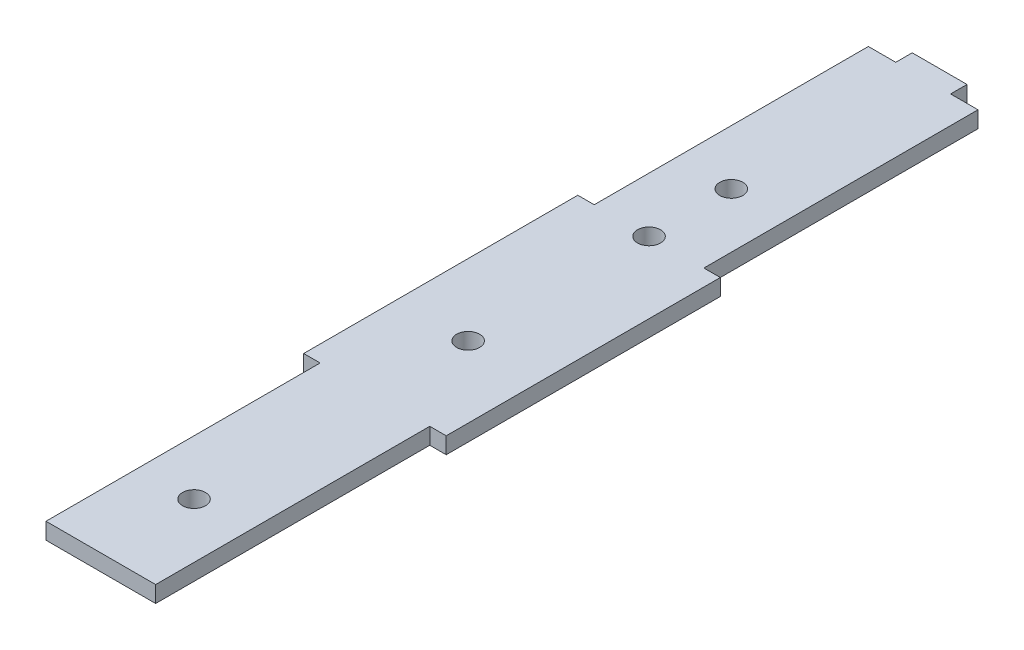
ISO-10303-21;
HEADER;
FILE_DESCRIPTION(('STEP AP214'),'2;1');
FILE_NAME('part.step','',(''),(''),'','','');
FILE_SCHEMA(('AUTOMOTIVE_DESIGN { 1 0 10303 214 1 1 1 1 }'));
ENDSEC;
DATA;
#1=APPLICATION_CONTEXT('core data for automotive mechanical design processes');
#2=APPLICATION_PROTOCOL_DEFINITION('international standard','automotive_design',2000,#1);
#3=PRODUCT_CONTEXT('',#1,'mechanical');
#4=PRODUCT('Part','Part','',(#3));
#5=PRODUCT_RELATED_PRODUCT_CATEGORY('part','',(#4));
#6=PRODUCT_DEFINITION_FORMATION('','',#4);
#7=PRODUCT_DEFINITION_CONTEXT('part definition',#1,'design');
#8=PRODUCT_DEFINITION('design','',#6,#7);
#9=PRODUCT_DEFINITION_SHAPE('','',#8);
#10=(LENGTH_UNIT() NAMED_UNIT(*) SI_UNIT(.MILLI.,.METRE.));
#11=(NAMED_UNIT(*) PLANE_ANGLE_UNIT() SI_UNIT($,.RADIAN.));
#12=(NAMED_UNIT(*) SI_UNIT($,.STERADIAN.) SOLID_ANGLE_UNIT());
#13=UNCERTAINTY_MEASURE_WITH_UNIT(LENGTH_MEASURE(1.E-05),#10,'distance_accuracy_value','');
#14=(GEOMETRIC_REPRESENTATION_CONTEXT(3) GLOBAL_UNCERTAINTY_ASSIGNED_CONTEXT((#13)) GLOBAL_UNIT_ASSIGNED_CONTEXT((#10,
#11,#12)) REPRESENTATION_CONTEXT('',''));
#15=CARTESIAN_POINT('',(0.,0.,0.));
#16=DIRECTION('',(0.,0.,1.));
#17=DIRECTION('',(1.,0.,0.));
#18=AXIS2_PLACEMENT_3D('',#15,#16,#17);
#19=CARTESIAN_POINT('',(0.,3.,0.));
#20=DIRECTION('',(1.,0.,0.));
#21=DIRECTION('',(0.,0.,-1.));
#22=AXIS2_PLACEMENT_3D('',#19,#20,#21);
#23=PLANE('',#22);
#24=DIRECTION('',(0.,0.,1.));
#25=VECTOR('',#24,1.);
#26=CARTESIAN_POINT('',(0.,0.,0.));
#27=LINE('',#26,#25);
#28=CARTESIAN_POINT('',(0.,0.,0.));
#29=VERTEX_POINT('',#28);
#30=CARTESIAN_POINT('',(0.,0.,50.));
#31=VERTEX_POINT('',#30);
#32=EDGE_CURVE('E179',#29,#31,#27,.T.);
#33=ORIENTED_EDGE('',*,*,#32,.T.);
#34=DIRECTION('',(0.,-1.,0.));
#35=VECTOR('',#34,1.);
#36=CARTESIAN_POINT('',(0.,3.,50.));
#37=LINE('',#36,#35);
#38=CARTESIAN_POINT('',(0.,3.,50.));
#39=VERTEX_POINT('',#38);
#40=EDGE_CURVE('E11',#39,#31,#37,.T.);
#41=ORIENTED_EDGE('',*,*,#40,.F.);
#42=DIRECTION('',(0.,0.,1.));
#43=VECTOR('',#42,1.);
#44=CARTESIAN_POINT('',(0.,3.,0.));
#45=LINE('',#44,#43);
#46=CARTESIAN_POINT('',(0.,3.,0.));
#47=VERTEX_POINT('',#46);
#48=EDGE_CURVE('E210',#47,#39,#45,.T.);
#49=ORIENTED_EDGE('',*,*,#48,.F.);
#50=DIRECTION('',(0.,-1.,0.));
#51=VECTOR('',#50,1.);
#52=CARTESIAN_POINT('',(0.,3.,0.));
#53=LINE('',#52,#51);
#54=EDGE_CURVE('E175',#47,#29,#53,.T.);
#55=ORIENTED_EDGE('',*,*,#54,.T.);
#56=EDGE_LOOP('',(#33,#41,#49,#55));
#57=FACE_BOUND('',#56,.T.);
#58=ADVANCED_FACE('F35',(#57),#23,.F.);
#59=CARTESIAN_POINT('',(0.,3.,50.));
#60=DIRECTION('',(0.,0.,1.));
#61=DIRECTION('',(1.,0.,0.));
#62=AXIS2_PLACEMENT_3D('',#59,#60,#61);
#63=PLANE('',#62);
#64=DIRECTION('',(-1.,0.,0.));
#65=VECTOR('',#64,1.);
#66=CARTESIAN_POINT('',(0.,0.,50.));
#67=LINE('',#66,#65);
#68=CARTESIAN_POINT('',(-3.,0.,50.));
#69=VERTEX_POINT('',#68);
#70=EDGE_CURVE('E182',#31,#69,#67,.T.);
#71=ORIENTED_EDGE('',*,*,#70,.T.);
#72=DIRECTION('',(0.,-1.,0.));
#73=VECTOR('',#72,1.);
#74=CARTESIAN_POINT('',(-3.,3.,50.));
#75=LINE('',#74,#73);
#76=CARTESIAN_POINT('',(-3.,3.,50.));
#77=VERTEX_POINT('',#76);
#78=EDGE_CURVE('E43',#77,#69,#75,.T.);
#79=ORIENTED_EDGE('',*,*,#78,.F.);
#80=DIRECTION('',(-1.,0.,0.));
#81=VECTOR('',#80,1.);
#82=CARTESIAN_POINT('',(0.,3.,50.));
#83=LINE('',#82,#81);
#84=EDGE_CURVE('E118',#39,#77,#83,.T.);
#85=ORIENTED_EDGE('',*,*,#84,.F.);
#86=ORIENTED_EDGE('',*,*,#40,.T.);
#87=EDGE_LOOP('',(#71,#79,#85,#86));
#88=FACE_BOUND('',#87,.T.);
#89=ADVANCED_FACE('F310',(#88),#63,.F.);
#90=CARTESIAN_POINT('',(-3.,3.,50.));
#91=DIRECTION('',(1.,0.,0.));
#92=DIRECTION('',(0.,0.,-1.));
#93=AXIS2_PLACEMENT_3D('',#90,#91,#92);
#94=PLANE('',#93);
#95=DIRECTION('',(0.,0.,1.));
#96=VECTOR('',#95,1.);
#97=CARTESIAN_POINT('',(-3.,0.,50.));
#98=LINE('',#97,#96);
#99=CARTESIAN_POINT('',(-2.99999999999999,0.,100.));
#100=VERTEX_POINT('',#99);
#101=EDGE_CURVE('E185',#69,#100,#98,.T.);
#102=ORIENTED_EDGE('',*,*,#101,.T.);
#103=DIRECTION('',(0.,-1.,0.));
#104=VECTOR('',#103,1.);
#105=CARTESIAN_POINT('',(-2.99999999999999,3.,100.));
#106=LINE('',#105,#104);
#107=CARTESIAN_POINT('',(-2.99999999999999,3.,100.));
#108=VERTEX_POINT('',#107);
#109=EDGE_CURVE('E241',#108,#100,#106,.T.);
#110=ORIENTED_EDGE('',*,*,#109,.F.);
#111=DIRECTION('',(0.,0.,1.));
#112=VECTOR('',#111,1.);
#113=CARTESIAN_POINT('',(-3.,3.,50.));
#114=LINE('',#113,#112);
#115=EDGE_CURVE('E249',#77,#108,#114,.T.);
#116=ORIENTED_EDGE('',*,*,#115,.F.);
#117=ORIENTED_EDGE('',*,*,#78,.T.);
#118=EDGE_LOOP('',(#102,#110,#116,#117));
#119=FACE_BOUND('',#118,.T.);
#120=ADVANCED_FACE('F247',(#119),#94,.F.);
#121=CARTESIAN_POINT('',(0.,3.,100.));
#122=DIRECTION('',(0.,0.,-1.));
#123=DIRECTION('',(-1.,0.,0.));
#124=AXIS2_PLACEMENT_3D('',#121,#122,#123);
#125=PLANE('',#124);
#126=DIRECTION('',(1.,0.,0.));
#127=VECTOR('',#126,1.);
#128=CARTESIAN_POINT('',(0.,0.,100.));
#129=LINE('',#128,#127);
#130=CARTESIAN_POINT('',(0.,0.,100.));
#131=VERTEX_POINT('',#130);
#132=EDGE_CURVE('E187',#100,#131,#129,.T.);
#133=ORIENTED_EDGE('',*,*,#132,.T.);
#134=DIRECTION('',(0.,-1.,0.));
#135=VECTOR('',#134,1.);
#136=CARTESIAN_POINT('',(0.,3.,100.));
#137=LINE('',#136,#135);
#138=CARTESIAN_POINT('',(0.,3.,100.));
#139=VERTEX_POINT('',#138);
#140=EDGE_CURVE('E238',#139,#131,#137,.T.);
#141=ORIENTED_EDGE('',*,*,#140,.F.);
#142=DIRECTION('',(1.,0.,0.));
#143=VECTOR('',#142,1.);
#144=CARTESIAN_POINT('',(0.,3.,100.));
#145=LINE('',#144,#143);
#146=EDGE_CURVE('E267',#108,#139,#145,.T.);
#147=ORIENTED_EDGE('',*,*,#146,.F.);
#148=ORIENTED_EDGE('',*,*,#109,.T.);
#149=EDGE_LOOP('',(#133,#141,#147,#148));
#150=FACE_BOUND('',#149,.T.);
#151=ADVANCED_FACE('F258',(#150),#125,.F.);
#152=CARTESIAN_POINT('',(0.,3.,100.));
#153=DIRECTION('',(1.,0.,0.));
#154=DIRECTION('',(0.,0.,-1.));
#155=AXIS2_PLACEMENT_3D('',#152,#153,#154);
#156=PLANE('',#155);
#157=DIRECTION('',(0.,0.,1.));
#158=VECTOR('',#157,1.);
#159=CARTESIAN_POINT('',(0.,0.,100.));
#160=LINE('',#159,#158);
#161=CARTESIAN_POINT('',(0.,0.,150.));
#162=VERTEX_POINT('',#161);
#163=EDGE_CURVE('E189',#131,#162,#160,.T.);
#164=ORIENTED_EDGE('',*,*,#163,.T.);
#165=DIRECTION('',(0.,-1.,0.));
#166=VECTOR('',#165,1.);
#167=CARTESIAN_POINT('',(0.,3.,150.));
#168=LINE('',#167,#166);
#169=CARTESIAN_POINT('',(0.,3.,150.));
#170=VERTEX_POINT('',#169);
#171=EDGE_CURVE('E235',#170,#162,#168,.T.);
#172=ORIENTED_EDGE('',*,*,#171,.F.);
#173=DIRECTION('',(0.,0.,1.));
#174=VECTOR('',#173,1.);
#175=CARTESIAN_POINT('',(0.,3.,100.));
#176=LINE('',#175,#174);
#177=EDGE_CURVE('E264',#139,#170,#176,.T.);
#178=ORIENTED_EDGE('',*,*,#177,.F.);
#179=ORIENTED_EDGE('',*,*,#140,.T.);
#180=EDGE_LOOP('',(#164,#172,#178,#179));
#181=FACE_BOUND('',#180,.T.);
#182=ADVANCED_FACE('F262',(#181),#156,.F.);
#183=CARTESIAN_POINT('',(0.,3.,150.));
#184=DIRECTION('',(0.,0.,-1.));
#185=DIRECTION('',(-1.,0.,0.));
#186=AXIS2_PLACEMENT_3D('',#183,#184,#185);
#187=PLANE('',#186);
#188=DIRECTION('',(1.,0.,0.));
#189=VECTOR('',#188,1.);
#190=CARTESIAN_POINT('',(0.,0.,150.));
#191=LINE('',#190,#189);
#192=CARTESIAN_POINT('',(20.,0.,150.));
#193=VERTEX_POINT('',#192);
#194=EDGE_CURVE('E191',#162,#193,#191,.T.);
#195=ORIENTED_EDGE('',*,*,#194,.T.);
#196=DIRECTION('',(0.,-1.,0.));
#197=VECTOR('',#196,1.);
#198=CARTESIAN_POINT('',(20.,3.,150.));
#199=LINE('',#198,#197);
#200=CARTESIAN_POINT('',(20.,3.,150.));
#201=VERTEX_POINT('',#200);
#202=EDGE_CURVE('E232',#201,#193,#199,.T.);
#203=ORIENTED_EDGE('',*,*,#202,.F.);
#204=DIRECTION('',(1.,0.,0.));
#205=VECTOR('',#204,1.);
#206=CARTESIAN_POINT('',(0.,3.,150.));
#207=LINE('',#206,#205);
#208=EDGE_CURVE('E266',#170,#201,#207,.T.);
#209=ORIENTED_EDGE('',*,*,#208,.F.);
#210=ORIENTED_EDGE('',*,*,#171,.T.);
#211=EDGE_LOOP('',(#195,#203,#209,#210));
#212=FACE_BOUND('',#211,.T.);
#213=ADVANCED_FACE('F323',(#212),#187,.F.);
#214=CARTESIAN_POINT('',(20.,3.,100.));
#215=DIRECTION('',(-1.,0.,0.));
#216=DIRECTION('',(0.,0.,1.));
#217=AXIS2_PLACEMENT_3D('',#214,#215,#216);
#218=PLANE('',#217);
#219=DIRECTION('',(0.,0.,-1.));
#220=VECTOR('',#219,1.);
#221=CARTESIAN_POINT('',(20.,0.,100.));
#222=LINE('',#221,#220);
#223=CARTESIAN_POINT('',(20.,0.,100.));
#224=VERTEX_POINT('',#223);
#225=EDGE_CURVE('E193',#193,#224,#222,.T.);
#226=ORIENTED_EDGE('',*,*,#225,.T.);
#227=DIRECTION('',(0.,-1.,0.));
#228=VECTOR('',#227,1.);
#229=CARTESIAN_POINT('',(20.,3.,100.));
#230=LINE('',#229,#228);
#231=CARTESIAN_POINT('',(20.,3.,100.));
#232=VERTEX_POINT('',#231);
#233=EDGE_CURVE('E229',#232,#224,#230,.T.);
#234=ORIENTED_EDGE('',*,*,#233,.F.);
#235=DIRECTION('',(0.,0.,-1.));
#236=VECTOR('',#235,1.);
#237=CARTESIAN_POINT('',(20.,3.,100.));
#238=LINE('',#237,#236);
#239=EDGE_CURVE('E269',#201,#232,#238,.T.);
#240=ORIENTED_EDGE('',*,*,#239,.F.);
#241=ORIENTED_EDGE('',*,*,#202,.T.);
#242=EDGE_LOOP('',(#226,#234,#240,#241));
#243=FACE_BOUND('',#242,.T.);
#244=ADVANCED_FACE('F326',(#243),#218,.F.);
#245=CARTESIAN_POINT('',(20.,3.,100.));
#246=DIRECTION('',(0.,0.,-1.));
#247=DIRECTION('',(-1.,0.,0.));
#248=AXIS2_PLACEMENT_3D('',#245,#246,#247);
#249=PLANE('',#248);
#250=DIRECTION('',(1.,0.,0.));
#251=VECTOR('',#250,1.);
#252=CARTESIAN_POINT('',(20.,0.,100.));
#253=LINE('',#252,#251);
#254=CARTESIAN_POINT('',(23.,0.,100.));
#255=VERTEX_POINT('',#254);
#256=EDGE_CURVE('E195',#224,#255,#253,.T.);
#257=ORIENTED_EDGE('',*,*,#256,.T.);
#258=DIRECTION('',(0.,-1.,0.));
#259=VECTOR('',#258,1.);
#260=CARTESIAN_POINT('',(23.,3.,100.));
#261=LINE('',#260,#259);
#262=CARTESIAN_POINT('',(23.,3.,100.));
#263=VERTEX_POINT('',#262);
#264=EDGE_CURVE('E226',#263,#255,#261,.T.);
#265=ORIENTED_EDGE('',*,*,#264,.F.);
#266=DIRECTION('',(1.,0.,0.));
#267=VECTOR('',#266,1.);
#268=CARTESIAN_POINT('',(20.,3.,100.));
#269=LINE('',#268,#267);
#270=EDGE_CURVE('E275',#232,#263,#269,.T.);
#271=ORIENTED_EDGE('',*,*,#270,.F.);
#272=ORIENTED_EDGE('',*,*,#233,.T.);
#273=EDGE_LOOP('',(#257,#265,#271,#272));
#274=FACE_BOUND('',#273,.T.);
#275=ADVANCED_FACE('F330',(#274),#249,.F.);
#276=CARTESIAN_POINT('',(23.,3.,50.));
#277=DIRECTION('',(-1.,0.,0.));
#278=DIRECTION('',(0.,0.,1.));
#279=AXIS2_PLACEMENT_3D('',#276,#277,#278);
#280=PLANE('',#279);
#281=DIRECTION('',(0.,0.,-1.));
#282=VECTOR('',#281,1.);
#283=CARTESIAN_POINT('',(23.,0.,50.));
#284=LINE('',#283,#282);
#285=CARTESIAN_POINT('',(23.,0.,50.));
#286=VERTEX_POINT('',#285);
#287=EDGE_CURVE('E197',#255,#286,#284,.T.);
#288=ORIENTED_EDGE('',*,*,#287,.T.);
#289=DIRECTION('',(0.,-1.,0.));
#290=VECTOR('',#289,1.);
#291=CARTESIAN_POINT('',(23.,3.,50.));
#292=LINE('',#291,#290);
#293=CARTESIAN_POINT('',(23.,3.,50.));
#294=VERTEX_POINT('',#293);
#295=EDGE_CURVE('E223',#294,#286,#292,.T.);
#296=ORIENTED_EDGE('',*,*,#295,.F.);
#297=DIRECTION('',(0.,0.,-1.));
#298=VECTOR('',#297,1.);
#299=CARTESIAN_POINT('',(23.,3.,50.));
#300=LINE('',#299,#298);
#301=EDGE_CURVE('E277',#263,#294,#300,.T.);
#302=ORIENTED_EDGE('',*,*,#301,.F.);
#303=ORIENTED_EDGE('',*,*,#264,.T.);
#304=EDGE_LOOP('',(#288,#296,#302,#303));
#305=FACE_BOUND('',#304,.T.);
#306=ADVANCED_FACE('F334',(#305),#280,.F.);
#307=CARTESIAN_POINT('',(20.,3.,50.));
#308=DIRECTION('',(0.,0.,1.));
#309=DIRECTION('',(1.,0.,0.));
#310=AXIS2_PLACEMENT_3D('',#307,#308,#309);
#311=PLANE('',#310);
#312=DIRECTION('',(-1.,0.,0.));
#313=VECTOR('',#312,1.);
#314=CARTESIAN_POINT('',(20.,0.,50.));
#315=LINE('',#314,#313);
#316=CARTESIAN_POINT('',(20.,0.,50.));
#317=VERTEX_POINT('',#316);
#318=EDGE_CURVE('E199',#286,#317,#315,.T.);
#319=ORIENTED_EDGE('',*,*,#318,.T.);
#320=DIRECTION('',(0.,-1.,0.));
#321=VECTOR('',#320,1.);
#322=CARTESIAN_POINT('',(20.,3.,50.));
#323=LINE('',#322,#321);
#324=CARTESIAN_POINT('',(20.,3.,50.));
#325=VERTEX_POINT('',#324);
#326=EDGE_CURVE('E220',#325,#317,#323,.T.);
#327=ORIENTED_EDGE('',*,*,#326,.F.);
#328=DIRECTION('',(-1.,0.,0.));
#329=VECTOR('',#328,1.);
#330=CARTESIAN_POINT('',(20.,3.,50.));
#331=LINE('',#330,#329);
#332=EDGE_CURVE('E279',#294,#325,#331,.T.);
#333=ORIENTED_EDGE('',*,*,#332,.F.);
#334=ORIENTED_EDGE('',*,*,#295,.T.);
#335=EDGE_LOOP('',(#319,#327,#333,#334));
#336=FACE_BOUND('',#335,.T.);
#337=ADVANCED_FACE('F338',(#336),#311,.F.);
#338=CARTESIAN_POINT('',(20.,3.,0.));
#339=DIRECTION('',(-1.,0.,0.));
#340=DIRECTION('',(0.,0.,1.));
#341=AXIS2_PLACEMENT_3D('',#338,#339,#340);
#342=PLANE('',#341);
#343=DIRECTION('',(0.,0.,-1.));
#344=VECTOR('',#343,1.);
#345=CARTESIAN_POINT('',(20.,0.,0.));
#346=LINE('',#345,#344);
#347=CARTESIAN_POINT('',(20.,0.,0.));
#348=VERTEX_POINT('',#347);
#349=EDGE_CURVE('E201',#317,#348,#346,.T.);
#350=ORIENTED_EDGE('',*,*,#349,.T.);
#351=DIRECTION('',(0.,-1.,0.));
#352=VECTOR('',#351,1.);
#353=CARTESIAN_POINT('',(20.,3.,0.));
#354=LINE('',#353,#352);
#355=CARTESIAN_POINT('',(20.,3.,0.));
#356=VERTEX_POINT('',#355);
#357=EDGE_CURVE('E217',#356,#348,#354,.T.);
#358=ORIENTED_EDGE('',*,*,#357,.F.);
#359=DIRECTION('',(0.,0.,-1.));
#360=VECTOR('',#359,1.);
#361=CARTESIAN_POINT('',(20.,3.,0.));
#362=LINE('',#361,#360);
#363=EDGE_CURVE('E281',#325,#356,#362,.T.);
#364=ORIENTED_EDGE('',*,*,#363,.F.);
#365=ORIENTED_EDGE('',*,*,#326,.T.);
#366=EDGE_LOOP('',(#350,#358,#364,#365));
#367=FACE_BOUND('',#366,.T.);
#368=ADVANCED_FACE('F342',(#367),#342,.F.);
#369=CARTESIAN_POINT('',(15.,3.,0.));
#370=DIRECTION('',(0.,0.,1.));
#371=DIRECTION('',(1.,0.,0.));
#372=AXIS2_PLACEMENT_3D('',#369,#370,#371);
#373=PLANE('',#372);
#374=DIRECTION('',(-1.,0.,0.));
#375=VECTOR('',#374,1.);
#376=CARTESIAN_POINT('',(15.,0.,0.));
#377=LINE('',#376,#375);
#378=CARTESIAN_POINT('',(15.,0.,0.));
#379=VERTEX_POINT('',#378);
#380=EDGE_CURVE('E203',#348,#379,#377,.T.);
#381=ORIENTED_EDGE('',*,*,#380,.T.);
#382=DIRECTION('',(0.,-1.,0.));
#383=VECTOR('',#382,1.);
#384=CARTESIAN_POINT('',(15.,3.,0.));
#385=LINE('',#384,#383);
#386=CARTESIAN_POINT('',(15.,3.,0.));
#387=VERTEX_POINT('',#386);
#388=EDGE_CURVE('E214',#387,#379,#385,.T.);
#389=ORIENTED_EDGE('',*,*,#388,.F.);
#390=DIRECTION('',(-1.,0.,0.));
#391=VECTOR('',#390,1.);
#392=CARTESIAN_POINT('',(15.,3.,0.));
#393=LINE('',#392,#391);
#394=EDGE_CURVE('E283',#356,#387,#393,.T.);
#395=ORIENTED_EDGE('',*,*,#394,.F.);
#396=ORIENTED_EDGE('',*,*,#357,.T.);
#397=EDGE_LOOP('',(#381,#389,#395,#396));
#398=FACE_BOUND('',#397,.T.);
#399=ADVANCED_FACE('F289',(#398),#373,.F.);
#400=CARTESIAN_POINT('',(15.,3.,-3.));
#401=DIRECTION('',(-1.,0.,0.));
#402=DIRECTION('',(0.,0.,1.));
#403=AXIS2_PLACEMENT_3D('',#400,#401,#402);
#404=PLANE('',#403);
#405=DIRECTION('',(0.,0.,-1.));
#406=VECTOR('',#405,1.);
#407=CARTESIAN_POINT('',(15.,0.,-3.));
#408=LINE('',#407,#406);
#409=CARTESIAN_POINT('',(15.,0.,-3.));
#410=VERTEX_POINT('',#409);
#411=EDGE_CURVE('E205',#379,#410,#408,.T.);
#412=ORIENTED_EDGE('',*,*,#411,.T.);
#413=DIRECTION('',(0.,-1.,0.));
#414=VECTOR('',#413,1.);
#415=CARTESIAN_POINT('',(15.,3.,-3.));
#416=LINE('',#415,#414);
#417=CARTESIAN_POINT('',(15.,3.,-3.));
#418=VERTEX_POINT('',#417);
#419=EDGE_CURVE('E170',#418,#410,#416,.T.);
#420=ORIENTED_EDGE('',*,*,#419,.F.);
#421=DIRECTION('',(0.,0.,-1.));
#422=VECTOR('',#421,1.);
#423=CARTESIAN_POINT('',(15.,3.,-3.));
#424=LINE('',#423,#422);
#425=EDGE_CURVE('E161',#387,#418,#424,.T.);
#426=ORIENTED_EDGE('',*,*,#425,.F.);
#427=ORIENTED_EDGE('',*,*,#388,.T.);
#428=EDGE_LOOP('',(#412,#420,#426,#427));
#429=FACE_BOUND('',#428,.T.);
#430=ADVANCED_FACE('F293',(#429),#404,.F.);
#431=CARTESIAN_POINT('',(5.,3.,-3.));
#432=DIRECTION('',(0.,0.,1.));
#433=DIRECTION('',(1.,0.,0.));
#434=AXIS2_PLACEMENT_3D('',#431,#432,#433);
#435=PLANE('',#434);
#436=DIRECTION('',(-1.,0.,0.));
#437=VECTOR('',#436,1.);
#438=CARTESIAN_POINT('',(5.,0.,-3.));
#439=LINE('',#438,#437);
#440=CARTESIAN_POINT('',(5.,0.,-3.));
#441=VERTEX_POINT('',#440);
#442=EDGE_CURVE('E169',#410,#441,#439,.T.);
#443=ORIENTED_EDGE('',*,*,#442,.T.);
#444=DIRECTION('',(0.,-1.,0.));
#445=VECTOR('',#444,1.);
#446=CARTESIAN_POINT('',(5.,3.,-3.));
#447=LINE('',#446,#445);
#448=CARTESIAN_POINT('',(5.,3.,-3.));
#449=VERTEX_POINT('',#448);
#450=EDGE_CURVE('E166',#449,#441,#447,.T.);
#451=ORIENTED_EDGE('',*,*,#450,.F.);
#452=DIRECTION('',(-1.,0.,0.));
#453=VECTOR('',#452,1.);
#454=CARTESIAN_POINT('',(5.,3.,-3.));
#455=LINE('',#454,#453);
#456=EDGE_CURVE('E155',#418,#449,#455,.T.);
#457=ORIENTED_EDGE('',*,*,#456,.F.);
#458=ORIENTED_EDGE('',*,*,#419,.T.);
#459=EDGE_LOOP('',(#443,#451,#457,#458));
#460=FACE_BOUND('',#459,.T.);
#461=ADVANCED_FACE('F167',(#460),#435,.F.);
#462=CARTESIAN_POINT('',(5.,3.,-3.));
#463=DIRECTION('',(1.,0.,0.));
#464=DIRECTION('',(0.,0.,-1.));
#465=AXIS2_PLACEMENT_3D('',#462,#463,#464);
#466=PLANE('',#465);
#467=DIRECTION('',(0.,0.,1.));
#468=VECTOR('',#467,1.);
#469=CARTESIAN_POINT('',(5.,0.,-3.));
#470=LINE('',#469,#468);
#471=CARTESIAN_POINT('',(5.,0.,0.));
#472=VERTEX_POINT('',#471);
#473=EDGE_CURVE('E104',#441,#472,#470,.T.);
#474=ORIENTED_EDGE('',*,*,#473,.T.);
#475=DIRECTION('',(0.,-1.,0.));
#476=VECTOR('',#475,1.);
#477=CARTESIAN_POINT('',(5.,3.,0.));
#478=LINE('',#477,#476);
#479=CARTESIAN_POINT('',(5.,3.,0.));
#480=VERTEX_POINT('',#479);
#481=EDGE_CURVE('E171',#480,#472,#478,.T.);
#482=ORIENTED_EDGE('',*,*,#481,.F.);
#483=DIRECTION('',(0.,0.,1.));
#484=VECTOR('',#483,1.);
#485=CARTESIAN_POINT('',(5.,3.,-3.));
#486=LINE('',#485,#484);
#487=EDGE_CURVE('E159',#449,#480,#486,.T.);
#488=ORIENTED_EDGE('',*,*,#487,.F.);
#489=ORIENTED_EDGE('',*,*,#450,.T.);
#490=EDGE_LOOP('',(#474,#482,#488,#489));
#491=FACE_BOUND('',#490,.T.);
#492=ADVANCED_FACE('F173',(#491),#466,.F.);
#493=CARTESIAN_POINT('',(0.,3.,0.));
#494=DIRECTION('',(0.,0.,1.));
#495=DIRECTION('',(1.,0.,0.));
#496=AXIS2_PLACEMENT_3D('',#493,#494,#495);
#497=PLANE('',#496);
#498=DIRECTION('',(-1.,0.,0.));
#499=VECTOR('',#498,1.);
#500=CARTESIAN_POINT('',(0.,0.,0.));
#501=LINE('',#500,#499);
#502=EDGE_CURVE('E110',#472,#29,#501,.T.);
#503=ORIENTED_EDGE('',*,*,#502,.T.);
#504=ORIENTED_EDGE('',*,*,#54,.F.);
#505=DIRECTION('',(-1.,0.,0.));
#506=VECTOR('',#505,1.);
#507=CARTESIAN_POINT('',(0.,3.,0.));
#508=LINE('',#507,#506);
#509=EDGE_CURVE('E51',#480,#47,#508,.T.);
#510=ORIENTED_EDGE('',*,*,#509,.F.);
#511=ORIENTED_EDGE('',*,*,#481,.T.);
#512=EDGE_LOOP('',(#503,#504,#510,#511));
#513=FACE_BOUND('',#512,.T.);
#514=ADVANCED_FACE('F297',(#513),#497,.F.);
#515=CARTESIAN_POINT('',(0.,3.,0.));
#516=DIRECTION('',(0.,-1.,0.));
#517=DIRECTION('',(0.,0.,-1.));
#518=AXIS2_PLACEMENT_3D('',#515,#516,#517);
#519=PLANE('',#518);
#520=CARTESIAN_POINT('',(10.,3.,35.));
#521=DIRECTION('',(0.,1.,0.));
#522=DIRECTION('',(0.,0.,1.));
#523=AXIS2_PLACEMENT_3D('',#520,#521,#522);
#524=CIRCLE('',#523,2.1);
#525=CARTESIAN_POINT('',(10.,3.,37.1));
#526=VERTEX_POINT('',#525);
#527=EDGE_CURVE('E422',#526,#526,#524,.T.);
#528=ORIENTED_EDGE('',*,*,#527,.F.);
#529=EDGE_LOOP('',(#528));
#530=FACE_BOUND('',#529,.T.);
#531=CARTESIAN_POINT('',(10.,3.,50.));
#532=DIRECTION('',(0.,1.,0.));
#533=DIRECTION('',(0.,0.,1.));
#534=AXIS2_PLACEMENT_3D('',#531,#532,#533);
#535=CIRCLE('',#534,2.1);
#536=CARTESIAN_POINT('',(10.,3.,52.1));
#537=VERTEX_POINT('',#536);
#538=EDGE_CURVE('E427',#537,#537,#535,.T.);
#539=ORIENTED_EDGE('',*,*,#538,.F.);
#540=EDGE_LOOP('',(#539));
#541=FACE_BOUND('',#540,.T.);
#542=CARTESIAN_POINT('',(10.,3.,83.));
#543=DIRECTION('',(0.,1.,0.));
#544=DIRECTION('',(0.,0.,1.));
#545=AXIS2_PLACEMENT_3D('',#542,#543,#544);
#546=CIRCLE('',#545,2.1);
#547=CARTESIAN_POINT('',(10.,3.,85.1));
#548=VERTEX_POINT('',#547);
#549=EDGE_CURVE('E435',#548,#548,#546,.T.);
#550=ORIENTED_EDGE('',*,*,#549,.F.);
#551=EDGE_LOOP('',(#550));
#552=FACE_BOUND('',#551,.T.);
#553=CARTESIAN_POINT('',(10.,3.,133.));
#554=DIRECTION('',(0.,1.,0.));
#555=DIRECTION('',(0.,0.,1.));
#556=AXIS2_PLACEMENT_3D('',#553,#554,#555);
#557=CIRCLE('',#556,2.1);
#558=CARTESIAN_POINT('',(10.,3.,135.1));
#559=VERTEX_POINT('',#558);
#560=EDGE_CURVE('E441',#559,#559,#557,.T.);
#561=ORIENTED_EDGE('',*,*,#560,.F.);
#562=EDGE_LOOP('',(#561));
#563=FACE_BOUND('',#562,.T.);
#564=ORIENTED_EDGE('',*,*,#48,.T.);
#565=ORIENTED_EDGE('',*,*,#84,.T.);
#566=ORIENTED_EDGE('',*,*,#115,.T.);
#567=ORIENTED_EDGE('',*,*,#146,.T.);
#568=ORIENTED_EDGE('',*,*,#177,.T.);
#569=ORIENTED_EDGE('',*,*,#208,.T.);
#570=ORIENTED_EDGE('',*,*,#239,.T.);
#571=ORIENTED_EDGE('',*,*,#270,.T.);
#572=ORIENTED_EDGE('',*,*,#301,.T.);
#573=ORIENTED_EDGE('',*,*,#332,.T.);
#574=ORIENTED_EDGE('',*,*,#363,.T.);
#575=ORIENTED_EDGE('',*,*,#394,.T.);
#576=ORIENTED_EDGE('',*,*,#425,.T.);
#577=ORIENTED_EDGE('',*,*,#456,.T.);
#578=ORIENTED_EDGE('',*,*,#487,.T.);
#579=ORIENTED_EDGE('',*,*,#509,.T.);
#580=EDGE_LOOP('',(#564,#565,#566,#567,#568,#569,#570,#571,#572,#573,#574,#575,#576,#577,#578,#579));
#581=FACE_BOUND('',#580,.T.);
#582=ADVANCED_FACE('F157',(#530,#541,#552,#563,#581),#519,.F.);
#583=CARTESIAN_POINT('',(0.,0.,0.));
#584=DIRECTION('',(0.,-1.,0.));
#585=DIRECTION('',(0.,0.,-1.));
#586=AXIS2_PLACEMENT_3D('',#583,#584,#585);
#587=PLANE('',#586);
#588=CARTESIAN_POINT('',(10.,0.,35.));
#589=DIRECTION('',(0.,1.,0.));
#590=DIRECTION('',(0.,0.,1.));
#591=AXIS2_PLACEMENT_3D('',#588,#589,#590);
#592=CIRCLE('',#591,2.1);
#593=CARTESIAN_POINT('',(10.,0.,37.1));
#594=VERTEX_POINT('',#593);
#595=EDGE_CURVE('E183',#594,#594,#592,.T.);
#596=ORIENTED_EDGE('',*,*,#595,.T.);
#597=EDGE_LOOP('',(#596));
#598=FACE_BOUND('',#597,.T.);
#599=CARTESIAN_POINT('',(10.,0.,50.));
#600=DIRECTION('',(0.,1.,0.));
#601=DIRECTION('',(0.,0.,1.));
#602=AXIS2_PLACEMENT_3D('',#599,#600,#601);
#603=CIRCLE('',#602,2.1);
#604=CARTESIAN_POINT('',(10.,0.,52.1));
#605=VERTEX_POINT('',#604);
#606=EDGE_CURVE('E423',#605,#605,#603,.T.);
#607=ORIENTED_EDGE('',*,*,#606,.T.);
#608=EDGE_LOOP('',(#607));
#609=FACE_BOUND('',#608,.T.);
#610=CARTESIAN_POINT('',(10.,0.,83.));
#611=DIRECTION('',(0.,1.,0.));
#612=DIRECTION('',(0.,0.,1.));
#613=AXIS2_PLACEMENT_3D('',#610,#611,#612);
#614=CIRCLE('',#613,2.1);
#615=CARTESIAN_POINT('',(10.,0.,85.1));
#616=VERTEX_POINT('',#615);
#617=EDGE_CURVE('E432',#616,#616,#614,.T.);
#618=ORIENTED_EDGE('',*,*,#617,.T.);
#619=EDGE_LOOP('',(#618));
#620=FACE_BOUND('',#619,.T.);
#621=CARTESIAN_POINT('',(10.,0.,133.));
#622=DIRECTION('',(0.,1.,0.));
#623=DIRECTION('',(0.,0.,1.));
#624=AXIS2_PLACEMENT_3D('',#621,#622,#623);
#625=CIRCLE('',#624,2.1);
#626=CARTESIAN_POINT('',(10.,0.,135.1));
#627=VERTEX_POINT('',#626);
#628=EDGE_CURVE('E438',#627,#627,#625,.T.);
#629=ORIENTED_EDGE('',*,*,#628,.T.);
#630=EDGE_LOOP('',(#629));
#631=FACE_BOUND('',#630,.T.);
#632=ORIENTED_EDGE('',*,*,#32,.F.);
#633=ORIENTED_EDGE('',*,*,#502,.F.);
#634=ORIENTED_EDGE('',*,*,#473,.F.);
#635=ORIENTED_EDGE('',*,*,#442,.F.);
#636=ORIENTED_EDGE('',*,*,#411,.F.);
#637=ORIENTED_EDGE('',*,*,#380,.F.);
#638=ORIENTED_EDGE('',*,*,#349,.F.);
#639=ORIENTED_EDGE('',*,*,#318,.F.);
#640=ORIENTED_EDGE('',*,*,#287,.F.);
#641=ORIENTED_EDGE('',*,*,#256,.F.);
#642=ORIENTED_EDGE('',*,*,#225,.F.);
#643=ORIENTED_EDGE('',*,*,#194,.F.);
#644=ORIENTED_EDGE('',*,*,#163,.F.);
#645=ORIENTED_EDGE('',*,*,#132,.F.);
#646=ORIENTED_EDGE('',*,*,#101,.F.);
#647=ORIENTED_EDGE('',*,*,#70,.F.);
#648=EDGE_LOOP('',(#632,#633,#634,#635,#636,#637,#638,#639,#640,#641,#642,#643,#644,#645,#646,#647));
#649=FACE_BOUND('',#648,.T.);
#650=ADVANCED_FACE('F253',(#598,#609,#620,#631,#649),#587,.T.);
#651=CARTESIAN_POINT('',(10.,0.,133.));
#652=DIRECTION('',(0.,1.,0.));
#653=DIRECTION('',(0.,0.,1.));
#654=AXIS2_PLACEMENT_3D('',#651,#652,#653);
#655=CYLINDRICAL_SURFACE('',#654,2.1);
#656=ORIENTED_EDGE('',*,*,#628,.F.);
#657=EDGE_LOOP('',(#656));
#658=FACE_BOUND('',#657,.T.);
#659=ORIENTED_EDGE('',*,*,#560,.T.);
#660=EDGE_LOOP('',(#659));
#661=FACE_BOUND('',#660,.T.);
#662=ADVANCED_FACE('F375',(#658,#661),#655,.F.);
#663=CARTESIAN_POINT('',(10.,0.,83.));
#664=DIRECTION('',(0.,1.,0.));
#665=DIRECTION('',(0.,0.,1.));
#666=AXIS2_PLACEMENT_3D('',#663,#664,#665);
#667=CYLINDRICAL_SURFACE('',#666,2.1);
#668=ORIENTED_EDGE('',*,*,#617,.F.);
#669=EDGE_LOOP('',(#668));
#670=FACE_BOUND('',#669,.T.);
#671=ORIENTED_EDGE('',*,*,#549,.T.);
#672=EDGE_LOOP('',(#671));
#673=FACE_BOUND('',#672,.T.);
#674=ADVANCED_FACE('F383',(#670,#673),#667,.F.);
#675=CARTESIAN_POINT('',(10.,0.,50.));
#676=DIRECTION('',(0.,1.,0.));
#677=DIRECTION('',(0.,0.,1.));
#678=AXIS2_PLACEMENT_3D('',#675,#676,#677);
#679=CYLINDRICAL_SURFACE('',#678,2.1);
#680=ORIENTED_EDGE('',*,*,#606,.F.);
#681=EDGE_LOOP('',(#680));
#682=FACE_BOUND('',#681,.T.);
#683=ORIENTED_EDGE('',*,*,#538,.T.);
#684=EDGE_LOOP('',(#683));
#685=FACE_BOUND('',#684,.T.);
#686=ADVANCED_FACE('F393',(#682,#685),#679,.F.);
#687=CARTESIAN_POINT('',(10.,0.,35.));
#688=DIRECTION('',(0.,1.,0.));
#689=DIRECTION('',(0.,0.,1.));
#690=AXIS2_PLACEMENT_3D('',#687,#688,#689);
#691=CYLINDRICAL_SURFACE('',#690,2.1);
#692=ORIENTED_EDGE('',*,*,#595,.F.);
#693=EDGE_LOOP('',(#692));
#694=FACE_BOUND('',#693,.T.);
#695=ORIENTED_EDGE('',*,*,#527,.T.);
#696=EDGE_LOOP('',(#695));
#697=FACE_BOUND('',#696,.T.);
#698=ADVANCED_FACE('F403',(#694,#697),#691,.F.);
#699=CLOSED_SHELL('',(#58,#89,#120,#151,#182,#213,#244,#275,#306,#337,#368,#399,#430,#461,#492,
#514,#582,#650,#662,#674,#686,#698));
#700=MANIFOLD_SOLID_BREP('B2',#699);
#701=ADVANCED_BREP_SHAPE_REPRESENTATION('',(#18,#700),#14);
#702=SHAPE_DEFINITION_REPRESENTATION(#9,#701);
ENDSEC;
END-ISO-10303-21;
